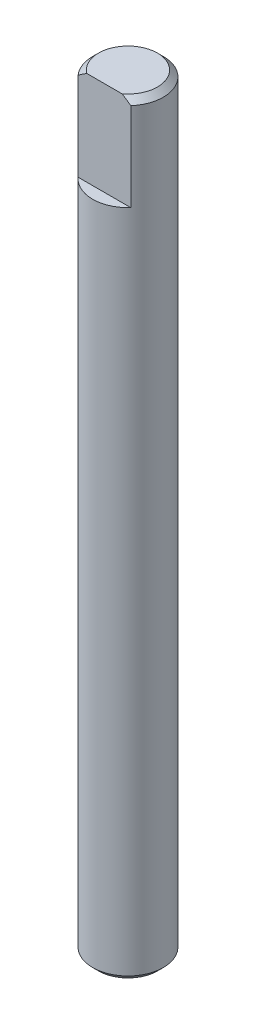
ISO-10303-21;
HEADER;
FILE_DESCRIPTION(('STEP AP214'),'2;1');
FILE_NAME('part.step','',(''),(''),'','','');
FILE_SCHEMA(('AUTOMOTIVE_DESIGN { 1 0 10303 214 1 1 1 1 }'));
ENDSEC;
DATA;
#1=APPLICATION_CONTEXT('core data for automotive mechanical design processes');
#2=APPLICATION_PROTOCOL_DEFINITION('international standard','automotive_design',2000,#1);
#3=PRODUCT_CONTEXT('',#1,'mechanical');
#4=PRODUCT('Part','Part','',(#3));
#5=PRODUCT_RELATED_PRODUCT_CATEGORY('part','',(#4));
#6=PRODUCT_DEFINITION_FORMATION('','',#4);
#7=PRODUCT_DEFINITION_CONTEXT('part definition',#1,'design');
#8=PRODUCT_DEFINITION('design','',#6,#7);
#9=PRODUCT_DEFINITION_SHAPE('','',#8);
#10=(LENGTH_UNIT() NAMED_UNIT(*) SI_UNIT(.MILLI.,.METRE.));
#11=(NAMED_UNIT(*) PLANE_ANGLE_UNIT() SI_UNIT($,.RADIAN.));
#12=(NAMED_UNIT(*) SI_UNIT($,.STERADIAN.) SOLID_ANGLE_UNIT());
#13=UNCERTAINTY_MEASURE_WITH_UNIT(LENGTH_MEASURE(1.E-05),#10,'distance_accuracy_value','');
#14=(GEOMETRIC_REPRESENTATION_CONTEXT(3) GLOBAL_UNCERTAINTY_ASSIGNED_CONTEXT((#13)) GLOBAL_UNIT_ASSIGNED_CONTEXT((#10,
#11,#12)) REPRESENTATION_CONTEXT('',''));
#15=CARTESIAN_POINT('',(0.,0.,0.));
#16=DIRECTION('',(0.,0.,1.));
#17=DIRECTION('',(1.,0.,0.));
#18=AXIS2_PLACEMENT_3D('',#15,#16,#17);
#19=CARTESIAN_POINT('',(0.,65.,0.));
#20=DIRECTION('',(0.,-1.,0.));
#21=DIRECTION('',(0.,0.,-1.));
#22=AXIS2_PLACEMENT_3D('',#19,#20,#21);
#23=CYLINDRICAL_SURFACE('',#22,3.);
#24=CARTESIAN_POINT('',(0.,0.5,0.));
#25=DIRECTION('',(0.,1.,0.));
#26=DIRECTION('',(0.,0.,1.));
#27=AXIS2_PLACEMENT_3D('',#24,#25,#26);
#28=CIRCLE('',#27,3.);
#29=CARTESIAN_POINT('',(0.,0.5,3.));
#30=VERTEX_POINT('',#29);
#31=EDGE_CURVE('E96',#30,#30,#28,.T.);
#32=ORIENTED_EDGE('',*,*,#31,.T.);
#33=EDGE_LOOP('',(#32));
#34=FACE_BOUND('',#33,.T.);
#35=DIRECTION('',(0.,1.,0.));
#36=VECTOR('',#35,1.);
#37=CARTESIAN_POINT('',(-2.23606797749979,57.,2.));
#38=LINE('',#37,#36);
#39=CARTESIAN_POINT('',(-2.23606797749979,57.,2.));
#40=VERTEX_POINT('',#39);
#41=CARTESIAN_POINT('',(-2.23606797749979,64.5,2.));
#42=VERTEX_POINT('',#41);
#43=EDGE_CURVE('E88',#40,#42,#38,.T.);
#44=ORIENTED_EDGE('',*,*,#43,.T.);
#45=CARTESIAN_POINT('',(0.,64.5,0.));
#46=DIRECTION('',(0.,1.,0.));
#47=DIRECTION('',(0.,0.,1.));
#48=AXIS2_PLACEMENT_3D('',#45,#46,#47);
#49=CIRCLE('',#48,3.);
#50=CARTESIAN_POINT('',(2.23606797749979,64.5,2.));
#51=VERTEX_POINT('',#50);
#52=EDGE_CURVE('E90',#42,#51,#49,.F.);
#53=ORIENTED_EDGE('',*,*,#52,.T.);
#54=DIRECTION('',(0.,1.,0.));
#55=VECTOR('',#54,1.);
#56=CARTESIAN_POINT('',(2.23606797749979,57.,2.));
#57=LINE('',#56,#55);
#58=CARTESIAN_POINT('',(2.23606797749979,57.,2.));
#59=VERTEX_POINT('',#58);
#60=EDGE_CURVE('E87',#59,#51,#57,.T.);
#61=ORIENTED_EDGE('',*,*,#60,.F.);
#62=CARTESIAN_POINT('',(0.,57.,0.));
#63=DIRECTION('',(0.,1.,0.));
#64=DIRECTION('',(0.,0.,1.));
#65=AXIS2_PLACEMENT_3D('',#62,#63,#64);
#66=CIRCLE('',#65,3.);
#67=EDGE_CURVE('E77',#40,#59,#66,.T.);
#68=ORIENTED_EDGE('',*,*,#67,.F.);
#69=EDGE_LOOP('',(#44,#53,#61,#68));
#70=FACE_BOUND('',#69,.T.);
#71=ADVANCED_FACE('F35',(#34,#70),#23,.T.);
#72=CARTESIAN_POINT('',(0.,65.,0.));
#73=DIRECTION('',(0.,1.,0.));
#74=DIRECTION('',(0.,0.,1.));
#75=AXIS2_PLACEMENT_3D('',#72,#73,#74);
#76=PLANE('',#75);
#77=DIRECTION('',(-1.,0.,0.));
#78=VECTOR('',#77,1.);
#79=CARTESIAN_POINT('',(-2.23606797749979,65.,2.));
#80=LINE('',#79,#78);
#81=CARTESIAN_POINT('',(1.49999999999997,65.,2.));
#82=VERTEX_POINT('',#81);
#83=CARTESIAN_POINT('',(-1.49999999999997,65.,2.));
#84=VERTEX_POINT('',#83);
#85=EDGE_CURVE('E84',#82,#84,#80,.T.);
#86=ORIENTED_EDGE('',*,*,#85,.F.);
#87=CARTESIAN_POINT('',(0.,65.,0.));
#88=DIRECTION('',(0.,1.,0.));
#89=DIRECTION('',(0.,0.,1.));
#90=AXIS2_PLACEMENT_3D('',#87,#88,#89);
#91=CIRCLE('',#90,2.49999999999998);
#92=EDGE_CURVE('E102',#82,#84,#91,.T.);
#93=ORIENTED_EDGE('',*,*,#92,.T.);
#94=EDGE_LOOP('',(#86,#93));
#95=FACE_BOUND('',#94,.T.);
#96=ADVANCED_FACE('F112',(#95),#76,.T.);
#97=CARTESIAN_POINT('',(0.,0.,0.));
#98=DIRECTION('',(0.,1.,0.));
#99=DIRECTION('',(0.,0.,1.));
#100=AXIS2_PLACEMENT_3D('',#97,#98,#99);
#101=PLANE('',#100);
#102=CARTESIAN_POINT('',(0.,0.,0.));
#103=DIRECTION('',(0.,1.,0.));
#104=DIRECTION('',(0.,0.,1.));
#105=AXIS2_PLACEMENT_3D('',#102,#103,#104);
#106=CIRCLE('',#105,2.5);
#107=CARTESIAN_POINT('',(0.,0.,2.5));
#108=VERTEX_POINT('',#107);
#109=EDGE_CURVE('E99',#108,#108,#106,.F.);
#110=ORIENTED_EDGE('',*,*,#109,.T.);
#111=EDGE_LOOP('',(#110));
#112=FACE_BOUND('',#111,.T.);
#113=ADVANCED_FACE('F111',(#112),#101,.F.);
#114=CARTESIAN_POINT('',(-2.23606797749979,57.,2.));
#115=DIRECTION('',(0.,0.,-1.));
#116=DIRECTION('',(-1.,0.,0.));
#117=AXIS2_PLACEMENT_3D('',#114,#115,#116);
#118=PLANE('',#117);
#119=ORIENTED_EDGE('',*,*,#85,.T.);
#120=CARTESIAN_POINT('',(-1.49999999999997,65.,2.));
#121=CARTESIAN_POINT('',(-1.56363441041133,64.9617993221427,2.));
#122=CARTESIAN_POINT('',(-1.62658889898813,64.9224920359349,2.));
#123=CARTESIAN_POINT('',(-1.75127191097623,64.8420572974233,2.));
#124=CARTESIAN_POINT('',(-1.81300116191586,64.800930975112,2.));
#125=CARTESIAN_POINT('',(-1.93543485253752,64.7172105304513,2.));
#126=CARTESIAN_POINT('',(-1.99613946258491,64.6746166557635,2.));
#127=CARTESIAN_POINT('',(-2.11670900846293,64.5881782263033,2.));
#128=CARTESIAN_POINT('',(-2.17657340830977,64.5443329228987,2.));
#129=CARTESIAN_POINT('',(-2.23606797749979,64.5,2.));
#130=B_SPLINE_CURVE_WITH_KNOTS('',3,(#120,#121,#122,#123,#124,#125,#126,#127,#128,#129),
.UNSPECIFIED.,.F.,.F.,(4,2,2,2,4),(0.,0.222629901922156,0.445123396049358,0.6675795247176,
0.890171642368408),.UNSPECIFIED.);
#131=EDGE_CURVE('E11',#84,#42,#130,.T.);
#132=ORIENTED_EDGE('',*,*,#131,.T.);
#133=ORIENTED_EDGE('',*,*,#43,.F.);
#134=DIRECTION('',(-1.,0.,0.));
#135=VECTOR('',#134,1.);
#136=CARTESIAN_POINT('',(-2.23606797749979,57.,2.));
#137=LINE('',#136,#135);
#138=EDGE_CURVE('E80',#59,#40,#137,.T.);
#139=ORIENTED_EDGE('',*,*,#138,.F.);
#140=ORIENTED_EDGE('',*,*,#60,.T.);
#141=CARTESIAN_POINT('',(2.23606797749979,64.5,2.));
#142=CARTESIAN_POINT('',(2.17657340830976,64.5443329228987,2.));
#143=CARTESIAN_POINT('',(2.11670900846292,64.5881782263033,2.));
#144=CARTESIAN_POINT('',(1.9961394625849,64.6746166557635,2.));
#145=CARTESIAN_POINT('',(1.93543485253751,64.7172105304513,2.));
#146=CARTESIAN_POINT('',(1.81300116191585,64.800930975112,2.));
#147=CARTESIAN_POINT('',(1.75127191097622,64.8420572974234,2.));
#148=CARTESIAN_POINT('',(1.62658889898812,64.9224920359349,2.));
#149=CARTESIAN_POINT('',(1.56363441041132,64.9617993221427,2.));
#150=CARTESIAN_POINT('',(1.49999999999996,65.,2.));
#151=B_SPLINE_CURVE_WITH_KNOTS('',3,(#141,#142,#143,#144,#145,#146,#147,#148,#149,#150),
.UNSPECIFIED.,.F.,.F.,(4,2,2,2,4),(0.,0.222592117650824,0.445048246319063,0.667541740446274,
0.890171642368411),.UNSPECIFIED.);
#152=EDGE_CURVE('E50',#51,#82,#151,.T.);
#153=ORIENTED_EDGE('',*,*,#152,.T.);
#154=EDGE_LOOP('',(#119,#132,#133,#139,#140,#153));
#155=FACE_BOUND('',#154,.T.);
#156=ADVANCED_FACE('F86',(#155),#118,.F.);
#157=CARTESIAN_POINT('',(0.,57.,0.));
#158=DIRECTION('',(0.,1.,0.));
#159=DIRECTION('',(0.,0.,1.));
#160=AXIS2_PLACEMENT_3D('',#157,#158,#159);
#161=PLANE('',#160);
#162=ORIENTED_EDGE('',*,*,#67,.T.);
#163=ORIENTED_EDGE('',*,*,#138,.T.);
#164=EDGE_LOOP('',(#162,#163));
#165=FACE_BOUND('',#164,.T.);
#166=ADVANCED_FACE('F79',(#165),#161,.T.);
#167=CARTESIAN_POINT('',(0.,0.5,0.));
#168=DIRECTION('',(0.,1.,0.));
#169=DIRECTION('',(0.,0.,1.));
#170=AXIS2_PLACEMENT_3D('',#167,#168,#169);
#171=CONICAL_SURFACE('',#170,3.,0.785398163397446);
#172=ORIENTED_EDGE('',*,*,#109,.F.);
#173=EDGE_LOOP('',(#172));
#174=FACE_BOUND('',#173,.T.);
#175=ORIENTED_EDGE('',*,*,#31,.F.);
#176=EDGE_LOOP('',(#175));
#177=FACE_BOUND('',#176,.T.);
#178=ADVANCED_FACE('F123',(#174,#177),#171,.T.);
#179=CARTESIAN_POINT('',(0.,65.,0.));
#180=DIRECTION('',(0.,-1.,0.));
#181=DIRECTION('',(0.,0.,-1.));
#182=AXIS2_PLACEMENT_3D('',#179,#180,#181);
#183=CONICAL_SURFACE('',#182,2.49999999999998,0.785398163397453);
#184=ORIENTED_EDGE('',*,*,#152,.F.);
#185=ORIENTED_EDGE('',*,*,#52,.F.);
#186=ORIENTED_EDGE('',*,*,#131,.F.);
#187=ORIENTED_EDGE('',*,*,#92,.F.);
#188=EDGE_LOOP('',(#184,#185,#186,#187));
#189=FACE_BOUND('',#188,.T.);
#190=ADVANCED_FACE('F38',(#189),#183,.T.);
#191=CLOSED_SHELL('',(#71,#96,#113,#156,#166,#178,#190));
#192=MANIFOLD_SOLID_BREP('B2',#191);
#193=ADVANCED_BREP_SHAPE_REPRESENTATION('',(#18,#192),#14);
#194=SHAPE_DEFINITION_REPRESENTATION(#9,#193);
ENDSEC;
END-ISO-10303-21;
